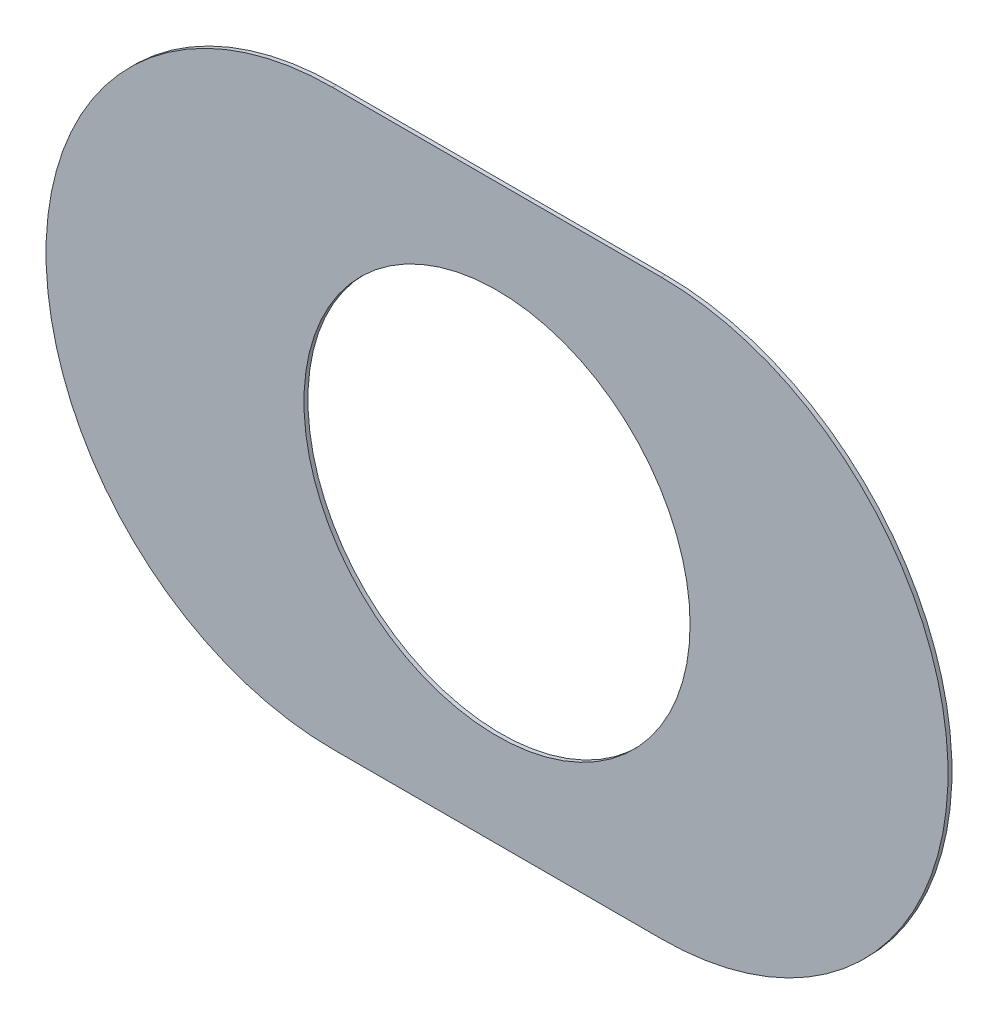
ISO-10303-21;
HEADER;
FILE_DESCRIPTION(('STEP AP214'),'2;1');
FILE_NAME('part.step','',(''),(''),'','','');
FILE_SCHEMA(('AUTOMOTIVE_DESIGN { 1 0 10303 214 1 1 1 1 }'));
ENDSEC;
DATA;
#1=APPLICATION_CONTEXT('core data for automotive mechanical design processes');
#2=APPLICATION_PROTOCOL_DEFINITION('international standard','automotive_design',2000,#1);
#3=PRODUCT_CONTEXT('',#1,'mechanical');
#4=PRODUCT('Part','Part','',(#3));
#5=PRODUCT_RELATED_PRODUCT_CATEGORY('part','',(#4));
#6=PRODUCT_DEFINITION_FORMATION('','',#4);
#7=PRODUCT_DEFINITION_CONTEXT('part definition',#1,'design');
#8=PRODUCT_DEFINITION('design','',#6,#7);
#9=PRODUCT_DEFINITION_SHAPE('','',#8);
#10=(LENGTH_UNIT() NAMED_UNIT(*) SI_UNIT(.MILLI.,.METRE.));
#11=(NAMED_UNIT(*) PLANE_ANGLE_UNIT() SI_UNIT($,.RADIAN.));
#12=(NAMED_UNIT(*) SI_UNIT($,.STERADIAN.) SOLID_ANGLE_UNIT());
#13=UNCERTAINTY_MEASURE_WITH_UNIT(LENGTH_MEASURE(1.E-05),#10,'distance_accuracy_value','');
#14=(GEOMETRIC_REPRESENTATION_CONTEXT(3) GLOBAL_UNCERTAINTY_ASSIGNED_CONTEXT((#13)) GLOBAL_UNIT_ASSIGNED_CONTEXT((#10,
#11,#12)) REPRESENTATION_CONTEXT('',''));
#15=CARTESIAN_POINT('',(0.,0.,0.));
#16=DIRECTION('',(0.,0.,1.));
#17=DIRECTION('',(1.,0.,0.));
#18=AXIS2_PLACEMENT_3D('',#15,#16,#17);
#19=CARTESIAN_POINT('',(24.3000003427268,24.7000006854535,0.));
#20=DIRECTION('',(0.,0.,1.));
#21=DIRECTION('',(1.,0.,0.));
#22=AXIS2_PLACEMENT_3D('',#19,#20,#21);
#23=PLANE('',#22);
#24=CARTESIAN_POINT('',(24.3000003427268,24.7000006854535,0.));
#25=DIRECTION('',(0.,0.,-1.));
#26=DIRECTION('',(-1.,0.,0.));
#27=AXIS2_PLACEMENT_3D('',#24,#25,#26);
#28=CIRCLE('',#27,0.49);
#29=CARTESIAN_POINT('',(24.7900003427268,24.7000006854535,0.));
#30=VERTEX_POINT('',#29);
#31=EDGE_CURVE('E95',#30,#30,#28,.T.);
#32=ORIENTED_EDGE('',*,*,#31,.T.);
#33=EDGE_LOOP('',(#32));
#34=FACE_BOUND('',#33,.T.);
#35=CARTESIAN_POINT('',(23.8825938881802,24.7000006854535,0.));
#36=DIRECTION('',(0.,0.,1.));
#37=DIRECTION('',(0.,1.,0.));
#38=AXIS2_PLACEMENT_3D('',#35,#36,#37);
#39=CIRCLE('',#38,0.727257121659981);
#40=CARTESIAN_POINT('',(23.8825938881802,25.4272578071135,0.));
#41=VERTEX_POINT('',#40);
#42=CARTESIAN_POINT('',(23.8825938881802,23.9727435637935,0.));
#43=VERTEX_POINT('',#42);
#44=EDGE_CURVE('E28',#41,#43,#39,.T.);
#45=ORIENTED_EDGE('',*,*,#44,.T.);
#46=DIRECTION('',(1.,0.,0.));
#47=VECTOR('',#46,1.);
#48=CARTESIAN_POINT('',(23.8825938881802,23.9727435637935,0.));
#49=LINE('',#48,#47);
#50=CARTESIAN_POINT('',(24.7174067972734,23.9727435637935,0.));
#51=VERTEX_POINT('',#50);
#52=EDGE_CURVE('E79',#43,#51,#49,.T.);
#53=ORIENTED_EDGE('',*,*,#52,.T.);
#54=CARTESIAN_POINT('',(24.7174067972734,24.7000006854535,0.));
#55=DIRECTION('',(0.,0.,1.));
#56=DIRECTION('',(0.,-1.,0.));
#57=AXIS2_PLACEMENT_3D('',#54,#55,#56);
#58=CIRCLE('',#57,0.727257121659981);
#59=CARTESIAN_POINT('',(24.7174067972734,25.4272578071135,0.));
#60=VERTEX_POINT('',#59);
#61=EDGE_CURVE('E114',#51,#60,#58,.T.);
#62=ORIENTED_EDGE('',*,*,#61,.T.);
#63=DIRECTION('',(-1.,0.,0.));
#64=VECTOR('',#63,1.);
#65=CARTESIAN_POINT('',(24.7174067972734,25.4272578071135,0.));
#66=LINE('',#65,#64);
#67=EDGE_CURVE('E21',#60,#41,#66,.T.);
#68=ORIENTED_EDGE('',*,*,#67,.T.);
#69=EDGE_LOOP('',(#45,#53,#62,#68));
#70=FACE_BOUND('',#69,.T.);
#71=ADVANCED_FACE('F17',(#34,#70),#23,.T.);
#72=CARTESIAN_POINT('',(24.3000003427268,24.7000006854535,-0.01));
#73=DIRECTION('',(0.,0.,1.));
#74=DIRECTION('',(1.,0.,0.));
#75=AXIS2_PLACEMENT_3D('',#72,#73,#74);
#76=PLANE('',#75);
#77=CARTESIAN_POINT('',(24.3000003427268,24.7000006854535,-0.01));
#78=DIRECTION('',(0.,0.,-1.));
#79=DIRECTION('',(-1.,0.,0.));
#80=AXIS2_PLACEMENT_3D('',#77,#78,#79);
#81=CIRCLE('',#80,0.49);
#82=CARTESIAN_POINT('',(24.7900003427268,24.7000006854535,-0.01));
#83=VERTEX_POINT('',#82);
#84=EDGE_CURVE('E105',#83,#83,#81,.T.);
#85=ORIENTED_EDGE('',*,*,#84,.F.);
#86=EDGE_LOOP('',(#85));
#87=FACE_BOUND('',#86,.T.);
#88=CARTESIAN_POINT('',(23.8825938881802,24.7000006854535,-0.01));
#89=DIRECTION('',(0.,0.,1.));
#90=DIRECTION('',(0.,1.,0.));
#91=AXIS2_PLACEMENT_3D('',#88,#89,#90);
#92=CIRCLE('',#91,0.727257121659981);
#93=CARTESIAN_POINT('',(23.8825938881802,25.4272578071135,-0.01));
#94=VERTEX_POINT('',#93);
#95=CARTESIAN_POINT('',(23.8825938881802,23.9727435637935,-0.01));
#96=VERTEX_POINT('',#95);
#97=EDGE_CURVE('E11',#94,#96,#92,.T.);
#98=ORIENTED_EDGE('',*,*,#97,.F.);
#99=DIRECTION('',(-1.,0.,0.));
#100=VECTOR('',#99,1.);
#101=CARTESIAN_POINT('',(24.7174067972734,25.4272578071135,-0.01));
#102=LINE('',#101,#100);
#103=CARTESIAN_POINT('',(24.7174067972734,25.4272578071135,-0.01));
#104=VERTEX_POINT('',#103);
#105=EDGE_CURVE('E82',#104,#94,#102,.T.);
#106=ORIENTED_EDGE('',*,*,#105,.F.);
#107=CARTESIAN_POINT('',(24.7174067972734,24.7000006854535,-0.01));
#108=DIRECTION('',(0.,0.,1.));
#109=DIRECTION('',(0.,-1.,0.));
#110=AXIS2_PLACEMENT_3D('',#107,#108,#109);
#111=CIRCLE('',#110,0.727257121659981);
#112=CARTESIAN_POINT('',(24.7174067972734,23.9727435637935,-0.01));
#113=VERTEX_POINT('',#112);
#114=EDGE_CURVE('E70',#113,#104,#111,.T.);
#115=ORIENTED_EDGE('',*,*,#114,.F.);
#116=DIRECTION('',(1.,0.,0.));
#117=VECTOR('',#116,1.);
#118=CARTESIAN_POINT('',(23.8825938881802,23.9727435637935,-0.01));
#119=LINE('',#118,#117);
#120=EDGE_CURVE('E100',#96,#113,#119,.T.);
#121=ORIENTED_EDGE('',*,*,#120,.F.);
#122=EDGE_LOOP('',(#98,#106,#115,#121));
#123=FACE_BOUND('',#122,.T.);
#124=ADVANCED_FACE('F83',(#87,#123),#76,.F.);
#125=CARTESIAN_POINT('',(23.8825938881802,24.7000006854535,0.));
#126=DIRECTION('',(0.,0.,1.));
#127=DIRECTION('',(0.,1.,0.));
#128=AXIS2_PLACEMENT_3D('',#125,#126,#127);
#129=CYLINDRICAL_SURFACE('',#128,0.727257121659981);
#130=ORIENTED_EDGE('',*,*,#44,.F.);
#131=DIRECTION('',(0.,0.,-1.));
#132=VECTOR('',#131,1.);
#133=CARTESIAN_POINT('',(23.8825938881802,25.4272578071135,0.));
#134=LINE('',#133,#132);
#135=EDGE_CURVE('E87',#41,#94,#134,.T.);
#136=ORIENTED_EDGE('',*,*,#135,.T.);
#137=ORIENTED_EDGE('',*,*,#97,.T.);
#138=DIRECTION('',(0.,0.,-1.));
#139=VECTOR('',#138,1.);
#140=CARTESIAN_POINT('',(23.8825938881802,23.9727435637935,0.));
#141=LINE('',#140,#139);
#142=EDGE_CURVE('E97',#43,#96,#141,.T.);
#143=ORIENTED_EDGE('',*,*,#142,.F.);
#144=EDGE_LOOP('',(#130,#136,#137,#143));
#145=FACE_BOUND('',#144,.T.);
#146=ADVANCED_FACE('F130',(#145),#129,.T.);
#147=CARTESIAN_POINT('',(23.8825938881802,23.9727435637935,0.));
#148=DIRECTION('',(0.,1.,0.));
#149=DIRECTION('',(1.,0.,0.));
#150=AXIS2_PLACEMENT_3D('',#147,#148,#149);
#151=PLANE('',#150);
#152=ORIENTED_EDGE('',*,*,#52,.F.);
#153=ORIENTED_EDGE('',*,*,#142,.T.);
#154=ORIENTED_EDGE('',*,*,#120,.T.);
#155=DIRECTION('',(0.,0.,-1.));
#156=VECTOR('',#155,1.);
#157=CARTESIAN_POINT('',(24.7174067972734,23.9727435637935,0.));
#158=LINE('',#157,#156);
#159=EDGE_CURVE('E77',#51,#113,#158,.T.);
#160=ORIENTED_EDGE('',*,*,#159,.F.);
#161=EDGE_LOOP('',(#152,#153,#154,#160));
#162=FACE_BOUND('',#161,.T.);
#163=ADVANCED_FACE('F135',(#162),#151,.F.);
#164=CARTESIAN_POINT('',(24.7174067972734,24.7000006854535,0.));
#165=DIRECTION('',(0.,0.,1.));
#166=DIRECTION('',(0.,-1.,0.));
#167=AXIS2_PLACEMENT_3D('',#164,#165,#166);
#168=CYLINDRICAL_SURFACE('',#167,0.727257121659981);
#169=ORIENTED_EDGE('',*,*,#61,.F.);
#170=ORIENTED_EDGE('',*,*,#159,.T.);
#171=ORIENTED_EDGE('',*,*,#114,.T.);
#172=DIRECTION('',(0.,0.,-1.));
#173=VECTOR('',#172,1.);
#174=CARTESIAN_POINT('',(24.7174067972734,25.4272578071135,0.));
#175=LINE('',#174,#173);
#176=EDGE_CURVE('E74',#60,#104,#175,.T.);
#177=ORIENTED_EDGE('',*,*,#176,.F.);
#178=EDGE_LOOP('',(#169,#170,#171,#177));
#179=FACE_BOUND('',#178,.T.);
#180=ADVANCED_FACE('F72',(#179),#168,.T.);
#181=CARTESIAN_POINT('',(24.7174067972734,25.4272578071135,0.));
#182=DIRECTION('',(0.,-1.,0.));
#183=DIRECTION('',(0.,0.,-1.));
#184=AXIS2_PLACEMENT_3D('',#181,#182,#183);
#185=PLANE('',#184);
#186=ORIENTED_EDGE('',*,*,#67,.F.);
#187=ORIENTED_EDGE('',*,*,#176,.T.);
#188=ORIENTED_EDGE('',*,*,#105,.T.);
#189=ORIENTED_EDGE('',*,*,#135,.F.);
#190=EDGE_LOOP('',(#186,#187,#188,#189));
#191=FACE_BOUND('',#190,.T.);
#192=ADVANCED_FACE('F19',(#191),#185,.F.);
#193=CARTESIAN_POINT('',(24.3000003427268,24.7000006854535,0.));
#194=DIRECTION('',(0.,0.,1.));
#195=DIRECTION('',(-1.,0.,0.));
#196=AXIS2_PLACEMENT_3D('',#193,#194,#195);
#197=CYLINDRICAL_SURFACE('',#196,0.49);
#198=ORIENTED_EDGE('',*,*,#84,.T.);
#199=DIRECTION('',(0.,0.,1.));
#200=VECTOR('',#199,1.);
#201=CARTESIAN_POINT('',(24.7900003427268,24.7000006854535,0.));
#202=LINE('',#201,#200);
#203=EDGE_CURVE('E108',#83,#30,#202,.T.);
#204=ORIENTED_EDGE('',*,*,#203,.T.);
#205=ORIENTED_EDGE('',*,*,#31,.F.);
#206=ORIENTED_EDGE('',*,*,#203,.F.);
#207=EDGE_LOOP('',(#198,#204,#205,#206));
#208=FACE_BOUND('',#207,.T.);
#209=ADVANCED_FACE('F143',(#208),#197,.F.);
#210=CLOSED_SHELL('',(#71,#124,#146,#163,#180,#192,#209));
#211=MANIFOLD_SOLID_BREP('B1',#210);
#212=ADVANCED_BREP_SHAPE_REPRESENTATION('',(#18,#211),#14);
#213=SHAPE_DEFINITION_REPRESENTATION(#9,#212);
ENDSEC;
END-ISO-10303-21;
